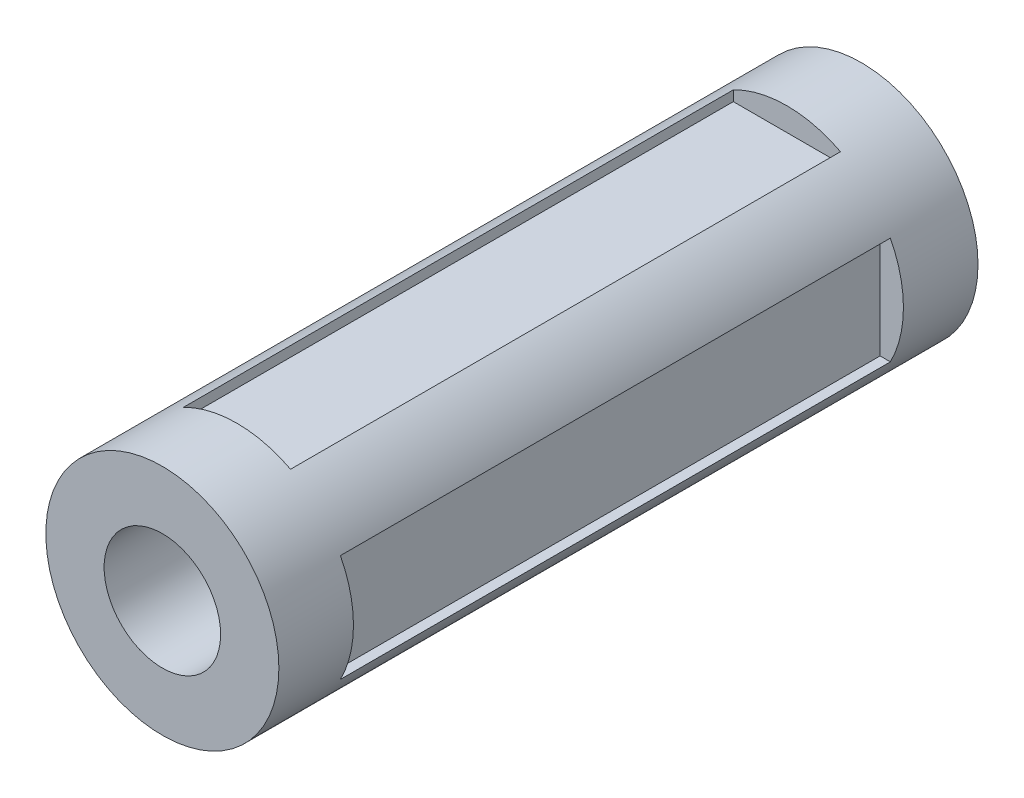
ISO-10303-21;
HEADER;
FILE_DESCRIPTION(('STEP AP214'),'2;1');
FILE_NAME('part.step','',(''),(''),'','','');
FILE_SCHEMA(('AUTOMOTIVE_DESIGN { 1 0 10303 214 1 1 1 1 }'));
ENDSEC;
DATA;
#1=APPLICATION_CONTEXT('core data for automotive mechanical design processes');
#2=APPLICATION_PROTOCOL_DEFINITION('international standard','automotive_design',2000,#1);
#3=PRODUCT_CONTEXT('',#1,'mechanical');
#4=PRODUCT('Part','Part','',(#3));
#5=PRODUCT_RELATED_PRODUCT_CATEGORY('part','',(#4));
#6=PRODUCT_DEFINITION_FORMATION('','',#4);
#7=PRODUCT_DEFINITION_CONTEXT('part definition',#1,'design');
#8=PRODUCT_DEFINITION('design','',#6,#7);
#9=PRODUCT_DEFINITION_SHAPE('','',#8);
#10=(LENGTH_UNIT() NAMED_UNIT(*) SI_UNIT(.MILLI.,.METRE.));
#11=(NAMED_UNIT(*) PLANE_ANGLE_UNIT() SI_UNIT($,.RADIAN.));
#12=(NAMED_UNIT(*) SI_UNIT($,.STERADIAN.) SOLID_ANGLE_UNIT());
#13=UNCERTAINTY_MEASURE_WITH_UNIT(LENGTH_MEASURE(1.E-05),#10,'distance_accuracy_value','');
#14=(GEOMETRIC_REPRESENTATION_CONTEXT(3) GLOBAL_UNCERTAINTY_ASSIGNED_CONTEXT((#13)) GLOBAL_UNIT_ASSIGNED_CONTEXT((#10,
#11,#12)) REPRESENTATION_CONTEXT('',''));
#15=CARTESIAN_POINT('',(0.,0.,0.));
#16=DIRECTION('',(0.,0.,1.));
#17=DIRECTION('',(1.,0.,0.));
#18=AXIS2_PLACEMENT_3D('',#15,#16,#17);
#19=CARTESIAN_POINT('',(0.,0.,300.));
#20=DIRECTION('',(0.,0.,-1.));
#21=DIRECTION('',(-1.,0.,0.));
#22=AXIS2_PLACEMENT_3D('',#19,#20,#21);
#23=CYLINDRICAL_SURFACE('',#22,50.);
#24=CARTESIAN_POINT('',(0.,0.,32.));
#25=DIRECTION('',(0.,0.,1.));
#26=DIRECTION('',(1.,0.,0.));
#27=AXIS2_PLACEMENT_3D('',#24,#25,#26);
#28=CIRCLE('',#27,50.);
#29=CARTESIAN_POINT('',(-22.9959939256583,-44.3980209398019,32.));
#30=VERTEX_POINT('',#29);
#31=CARTESIAN_POINT('',(22.9959939256583,-44.3980209398019,32.));
#32=VERTEX_POINT('',#31);
#33=EDGE_CURVE('E339',#30,#32,#28,.T.);
#34=ORIENTED_EDGE('',*,*,#33,.F.);
#35=CARTESIAN_POINT('',(-22.9999663385952,-44.3959631996366,268.0002));
#36=CARTESIAN_POINT('',(-22.9994052637973,-44.3962538724931,234.666866672656));
#37=CARTESIAN_POINT('',(-22.9988441889993,-44.3965445318595,201.333533345312));
#38=CARTESIAN_POINT('',(-22.9975200502315,-44.3972304572904,122.666733345312));
#39=CARTESIAN_POINT('',(-22.9967569862617,-44.3976257118937,77.3332666726562));
#40=CARTESIAN_POINT('',(-22.9959939222919,-44.3980209415455,31.9998));
#41=B_SPLINE_CURVE_WITH_KNOTS('',3,(#35,#36,#37,#38,#39,#40),.UNSPECIFIED.,.F.,.F.,(4,2,4),(0.,
100.,236.000400042403),.UNSPECIFIED.);
#42=CARTESIAN_POINT('',(-22.9999663352288,-44.3959632013806,268.));
#43=VERTEX_POINT('',#42);
#44=EDGE_CURVE('E357',#43,#30,#41,.T.);
#45=ORIENTED_EDGE('',*,*,#44,.F.);
#46=CARTESIAN_POINT('',(0.,0.,268.));
#47=DIRECTION('',(0.,0.,1.));
#48=DIRECTION('',(1.,0.,0.));
#49=AXIS2_PLACEMENT_3D('',#46,#47,#48);
#50=CIRCLE('',#49,50.);
#51=CARTESIAN_POINT('',(22.9999663352288,-44.3959632013807,268.));
#52=VERTEX_POINT('',#51);
#53=EDGE_CURVE('E60',#43,#52,#50,.T.);
#54=ORIENTED_EDGE('',*,*,#53,.T.);
#55=CARTESIAN_POINT('',(22.9959939222919,-44.3980209415455,31.9998));
#56=CARTESIAN_POINT('',(22.9965549970899,-44.397730332362,65.3331333273444));
#57=CARTESIAN_POINT('',(22.9971160718878,-44.3974397096885,98.6664666546888));
#58=CARTESIAN_POINT('',(22.9984402106556,-44.3967538071801,177.333266654689));
#59=CARTESIAN_POINT('',(22.9992032746254,-44.3963585158839,222.666733327345));
#60=CARTESIAN_POINT('',(22.9999663385952,-44.3959631996366,268.0002));
#61=B_SPLINE_CURVE_WITH_KNOTS('',3,(#55,#56,#57,#58,#59,#60),.UNSPECIFIED.,.F.,.F.,(4,2,4),(0.,
100.,236.000400042403),.UNSPECIFIED.);
#62=EDGE_CURVE('E393',#32,#52,#61,.T.);
#63=ORIENTED_EDGE('',*,*,#62,.F.);
#64=EDGE_LOOP('',(#34,#45,#54,#63));
#65=FACE_BOUND('',#64,.T.);
#66=CARTESIAN_POINT('',(0.,0.,32.));
#67=DIRECTION('',(0.,0.,1.));
#68=DIRECTION('',(1.,0.,0.));
#69=AXIS2_PLACEMENT_3D('',#66,#67,#68);
#70=CIRCLE('',#69,50.);
#71=CARTESIAN_POINT('',(22.9959939256583,44.3980209398019,32.));
#72=VERTEX_POINT('',#71);
#73=CARTESIAN_POINT('',(-22.9959939256583,44.3980209398019,32.));
#74=VERTEX_POINT('',#73);
#75=EDGE_CURVE('E252',#72,#74,#70,.T.);
#76=ORIENTED_EDGE('',*,*,#75,.F.);
#77=CARTESIAN_POINT('',(22.9999663385952,44.3959631996366,268.0002));
#78=CARTESIAN_POINT('',(22.9994052637973,44.3962538724931,234.666866672656));
#79=CARTESIAN_POINT('',(22.9988441889993,44.3965445318595,201.333533345312));
#80=CARTESIAN_POINT('',(22.9975200502315,44.3972304572904,122.666733345312));
#81=CARTESIAN_POINT('',(22.9967569862617,44.3976257118937,77.3332666726562));
#82=CARTESIAN_POINT('',(22.9959939222919,44.3980209415455,31.9998));
#83=B_SPLINE_CURVE_WITH_KNOTS('',3,(#77,#78,#79,#80,#81,#82),.UNSPECIFIED.,.F.,.F.,(4,2,4),(0.,
100.,236.000400042403),.UNSPECIFIED.);
#84=CARTESIAN_POINT('',(22.9999663352288,44.3959632013806,268.));
#85=VERTEX_POINT('',#84);
#86=EDGE_CURVE('E284',#85,#72,#83,.T.);
#87=ORIENTED_EDGE('',*,*,#86,.F.);
#88=CARTESIAN_POINT('',(0.,0.,268.));
#89=DIRECTION('',(0.,0.,1.));
#90=DIRECTION('',(1.,0.,0.));
#91=AXIS2_PLACEMENT_3D('',#88,#89,#90);
#92=CIRCLE('',#91,50.);
#93=CARTESIAN_POINT('',(-22.9999663352288,44.3959632013807,268.));
#94=VERTEX_POINT('',#93);
#95=EDGE_CURVE('E263',#85,#94,#92,.T.);
#96=ORIENTED_EDGE('',*,*,#95,.T.);
#97=CARTESIAN_POINT('',(-22.9959939222919,44.3980209415455,31.9998));
#98=CARTESIAN_POINT('',(-22.9965549970899,44.397730332362,65.3331333273444));
#99=CARTESIAN_POINT('',(-22.9971160718878,44.3974397096885,98.6664666546888));
#100=CARTESIAN_POINT('',(-22.9984402106556,44.3967538071801,177.333266654689));
#101=CARTESIAN_POINT('',(-22.9992032746254,44.3963585158839,222.666733327345));
#102=CARTESIAN_POINT('',(-22.9999663385952,44.3959631996366,268.0002));
#103=B_SPLINE_CURVE_WITH_KNOTS('',3,(#97,#98,#99,#100,#101,#102),.UNSPECIFIED.,.F.,.F.,(4,2,4),
(0.,100.,236.000400042403),.UNSPECIFIED.);
#104=EDGE_CURVE('E256',#74,#94,#103,.T.);
#105=ORIENTED_EDGE('',*,*,#104,.F.);
#106=EDGE_LOOP('',(#76,#87,#96,#105));
#107=FACE_BOUND('',#106,.T.);
#108=CARTESIAN_POINT('',(0.,0.,300.));
#109=DIRECTION('',(0.,0.,1.));
#110=DIRECTION('',(1.,0.,0.));
#111=AXIS2_PLACEMENT_3D('',#108,#109,#110);
#112=CIRCLE('',#111,50.);
#113=CARTESIAN_POINT('',(50.,0.,300.));
#114=VERTEX_POINT('',#113);
#115=EDGE_CURVE('E249',#114,#114,#112,.T.);
#116=ORIENTED_EDGE('',*,*,#115,.F.);
#117=EDGE_LOOP('',(#116));
#118=FACE_BOUND('',#117,.T.);
#119=CARTESIAN_POINT('',(0.,0.,0.));
#120=DIRECTION('',(0.,0.,1.));
#121=DIRECTION('',(1.,0.,0.));
#122=AXIS2_PLACEMENT_3D('',#119,#120,#121);
#123=CIRCLE('',#122,50.);
#124=CARTESIAN_POINT('',(50.,0.,0.));
#125=VERTEX_POINT('',#124);
#126=EDGE_CURVE('E246',#125,#125,#123,.T.);
#127=ORIENTED_EDGE('',*,*,#126,.T.);
#128=EDGE_LOOP('',(#127));
#129=FACE_BOUND('',#128,.T.);
#130=CARTESIAN_POINT('',(0.,0.,268.));
#131=DIRECTION('',(0.,0.,1.));
#132=DIRECTION('',(1.,0.,0.));
#133=AXIS2_PLACEMENT_3D('',#130,#131,#132);
#134=CIRCLE('',#133,50.);
#135=CARTESIAN_POINT('',(44.3959632013809,-22.9999663352283,268.));
#136=VERTEX_POINT('',#135);
#137=CARTESIAN_POINT('',(44.3959632013804,22.9999663352292,268.));
#138=VERTEX_POINT('',#137);
#139=EDGE_CURVE('E293',#136,#138,#134,.T.);
#140=ORIENTED_EDGE('',*,*,#139,.T.);
#141=CARTESIAN_POINT('',(44.3980209415453,22.9959939222923,31.9998));
#142=CARTESIAN_POINT('',(44.3977303323617,22.9965549970903,65.3331333273445));
#143=CARTESIAN_POINT('',(44.3974397096882,22.9971160718883,98.6664666546888));
#144=CARTESIAN_POINT('',(44.3967538071798,22.9984402106561,177.333266654689));
#145=CARTESIAN_POINT('',(44.3963585158837,22.9992032746259,222.666733327345));
#146=CARTESIAN_POINT('',(44.3959631996364,22.9999663385957,268.0002));
#147=B_SPLINE_CURVE_WITH_KNOTS('',3,(#141,#142,#143,#144,#145,#146),.UNSPECIFIED.,.F.,.F.,(4,2,
4),(0.,100.,236.000400042403),.UNSPECIFIED.);
#148=CARTESIAN_POINT('',(44.3980209398016,22.9959939256588,32.));
#149=VERTEX_POINT('',#148);
#150=EDGE_CURVE('E302',#149,#138,#147,.T.);
#151=ORIENTED_EDGE('',*,*,#150,.F.);
#152=CARTESIAN_POINT('',(0.,0.,32.));
#153=DIRECTION('',(0.,0.,1.));
#154=DIRECTION('',(1.,0.,0.));
#155=AXIS2_PLACEMENT_3D('',#152,#153,#154);
#156=CIRCLE('',#155,50.);
#157=CARTESIAN_POINT('',(44.3980209398021,-22.9959939256579,32.));
#158=VERTEX_POINT('',#157);
#159=EDGE_CURVE('E291',#158,#149,#156,.T.);
#160=ORIENTED_EDGE('',*,*,#159,.F.);
#161=CARTESIAN_POINT('',(44.3959631996368,-22.9999663385948,268.0002));
#162=CARTESIAN_POINT('',(44.3962538724933,-22.9994052637968,234.666866672656));
#163=CARTESIAN_POINT('',(44.3965445318597,-22.9988441889988,201.333533345312));
#164=CARTESIAN_POINT('',(44.3972304572907,-22.997520050231,122.666733345312));
#165=CARTESIAN_POINT('',(44.3976257118939,-22.9967569862612,77.3332666726562));
#166=CARTESIAN_POINT('',(44.3980209415458,-22.9959939222914,31.9998));
#167=B_SPLINE_CURVE_WITH_KNOTS('',3,(#161,#162,#163,#164,#165,#166),.UNSPECIFIED.,.F.,.F.,(4,2,
4),(0.,100.,236.000400042403),.UNSPECIFIED.);
#168=EDGE_CURVE('E295',#136,#158,#167,.T.);
#169=ORIENTED_EDGE('',*,*,#168,.F.);
#170=EDGE_LOOP('',(#140,#151,#160,#169));
#171=FACE_BOUND('',#170,.T.);
#172=CARTESIAN_POINT('',(0.,0.,32.));
#173=DIRECTION('',(0.,0.,1.));
#174=DIRECTION('',(1.,0.,0.));
#175=AXIS2_PLACEMENT_3D('',#172,#173,#174);
#176=CIRCLE('',#175,50.);
#177=CARTESIAN_POINT('',(-44.398020939802,22.9959939256582,32.));
#178=VERTEX_POINT('',#177);
#179=CARTESIAN_POINT('',(-44.3980209398018,-22.9959939256585,32.));
#180=VERTEX_POINT('',#179);
#181=EDGE_CURVE('E353',#178,#180,#176,.T.);
#182=ORIENTED_EDGE('',*,*,#181,.F.);
#183=CARTESIAN_POINT('',(-44.3959631996367,22.9999663385951,268.0002));
#184=CARTESIAN_POINT('',(-44.3962538724931,22.9994052637971,234.666866672656));
#185=CARTESIAN_POINT('',(-44.3965445318596,22.9988441889991,201.333533345312));
#186=CARTESIAN_POINT('',(-44.3972304572905,22.9975200502313,122.666733345312));
#187=CARTESIAN_POINT('',(-44.3976257118937,22.9967569862615,77.3332666726562));
#188=CARTESIAN_POINT('',(-44.3980209415456,22.9959939222917,31.9998));
#189=B_SPLINE_CURVE_WITH_KNOTS('',3,(#183,#184,#185,#186,#187,#188),.UNSPECIFIED.,.F.,.F.,(4,2,
4),(0.,100.,236.000400042403),.UNSPECIFIED.);
#190=CARTESIAN_POINT('',(-44.3959632013807,22.9999663352286,268.));
#191=VERTEX_POINT('',#190);
#192=EDGE_CURVE('E11',#191,#178,#189,.T.);
#193=ORIENTED_EDGE('',*,*,#192,.F.);
#194=CARTESIAN_POINT('',(0.,0.,268.));
#195=DIRECTION('',(0.,0.,1.));
#196=DIRECTION('',(1.,0.,0.));
#197=AXIS2_PLACEMENT_3D('',#194,#195,#196);
#198=CIRCLE('',#197,50.);
#199=CARTESIAN_POINT('',(-44.3959632013806,-22.9999663352289,268.));
#200=VERTEX_POINT('',#199);
#201=EDGE_CURVE('E46',#191,#200,#198,.T.);
#202=ORIENTED_EDGE('',*,*,#201,.T.);
#203=CARTESIAN_POINT('',(-44.3980209415454,-22.995993922292,31.9998));
#204=CARTESIAN_POINT('',(-44.3977303323619,-22.99655499709,65.3331333273444));
#205=CARTESIAN_POINT('',(-44.3974397096884,-22.997116071888,98.6664666546888));
#206=CARTESIAN_POINT('',(-44.39675380718,-22.9984402106558,177.333266654689));
#207=CARTESIAN_POINT('',(-44.3963585158838,-22.9992032746256,222.666733327345));
#208=CARTESIAN_POINT('',(-44.3959631996365,-22.9999663385954,268.0002));
#209=B_SPLINE_CURVE_WITH_KNOTS('',3,(#203,#204,#205,#206,#207,#208),.UNSPECIFIED.,.F.,.F.,(4,2,
4),(0.,100.,236.000400042403),.UNSPECIFIED.);
#210=EDGE_CURVE('E354',#180,#200,#209,.T.);
#211=ORIENTED_EDGE('',*,*,#210,.F.);
#212=EDGE_LOOP('',(#182,#193,#202,#211));
#213=FACE_BOUND('',#212,.T.);
#214=ADVANCED_FACE('F33',(#65,#107,#118,#129,#171,#213),#23,.T.);
#215=CARTESIAN_POINT('',(0.,0.,300.));
#216=DIRECTION('',(0.,0.,1.));
#217=DIRECTION('',(1.,0.,0.));
#218=AXIS2_PLACEMENT_3D('',#215,#216,#217);
#219=PLANE('',#218);
#220=ORIENTED_EDGE('',*,*,#115,.T.);
#221=EDGE_LOOP('',(#220));
#222=FACE_BOUND('',#221,.T.);
#223=CARTESIAN_POINT('',(0.,0.,300.));
#224=DIRECTION('',(0.,0.,1.));
#225=DIRECTION('',(1.,0.,0.));
#226=AXIS2_PLACEMENT_3D('',#223,#224,#225);
#227=CIRCLE('',#226,25.);
#228=CARTESIAN_POINT('',(25.,0.,300.));
#229=VERTEX_POINT('',#228);
#230=EDGE_CURVE('E243',#229,#229,#227,.T.);
#231=ORIENTED_EDGE('',*,*,#230,.F.);
#232=EDGE_LOOP('',(#231));
#233=FACE_BOUND('',#232,.T.);
#234=ADVANCED_FACE('F328',(#222,#233),#219,.T.);
#235=CARTESIAN_POINT('',(0.,0.,0.));
#236=DIRECTION('',(0.,0.,1.));
#237=DIRECTION('',(1.,0.,0.));
#238=AXIS2_PLACEMENT_3D('',#235,#236,#237);
#239=PLANE('',#238);
#240=ORIENTED_EDGE('',*,*,#126,.F.);
#241=EDGE_LOOP('',(#240));
#242=FACE_BOUND('',#241,.T.);
#243=CARTESIAN_POINT('',(0.,0.,0.));
#244=DIRECTION('',(0.,0.,1.));
#245=DIRECTION('',(1.,0.,0.));
#246=AXIS2_PLACEMENT_3D('',#243,#244,#245);
#247=CIRCLE('',#246,25.);
#248=CARTESIAN_POINT('',(25.,0.,0.));
#249=VERTEX_POINT('',#248);
#250=EDGE_CURVE('E234',#249,#249,#247,.T.);
#251=ORIENTED_EDGE('',*,*,#250,.T.);
#252=EDGE_LOOP('',(#251));
#253=FACE_BOUND('',#252,.T.);
#254=ADVANCED_FACE('F333',(#242,#253),#239,.F.);
#255=CARTESIAN_POINT('',(0.,0.,300.));
#256=DIRECTION('',(0.,0.,-1.));
#257=DIRECTION('',(-1.,0.,0.));
#258=AXIS2_PLACEMENT_3D('',#255,#256,#257);
#259=CYLINDRICAL_SURFACE('',#258,25.);
#260=ORIENTED_EDGE('',*,*,#230,.T.);
#261=EDGE_LOOP('',(#260));
#262=FACE_BOUND('',#261,.T.);
#263=ORIENTED_EDGE('',*,*,#250,.F.);
#264=EDGE_LOOP('',(#263));
#265=FACE_BOUND('',#264,.T.);
#266=ADVANCED_FACE('F545',(#262,#265),#259,.F.);
#267=CARTESIAN_POINT('',(-22.9999663352288,40.0000000000001,268.));
#268=DIRECTION('',(0.,0.,1.));
#269=DIRECTION('',(1.,0.,0.));
#270=AXIS2_PLACEMENT_3D('',#267,#268,#269);
#271=PLANE('',#270);
#272=DIRECTION('',(0.,1.,0.));
#273=VECTOR('',#272,1.);
#274=CARTESIAN_POINT('',(22.9999663352288,40.0000000000001,268.));
#275=LINE('',#274,#273);
#276=CARTESIAN_POINT('',(22.9999663352288,40.0000000000001,268.));
#277=VERTEX_POINT('',#276);
#278=EDGE_CURVE('E230',#277,#85,#275,.T.);
#279=ORIENTED_EDGE('',*,*,#278,.F.);
#280=DIRECTION('',(1.,0.,0.));
#281=VECTOR('',#280,1.);
#282=CARTESIAN_POINT('',(-22.9999663352288,40.0000000000001,268.));
#283=LINE('',#282,#281);
#284=CARTESIAN_POINT('',(-22.9999663352288,40.0000000000001,268.));
#285=VERTEX_POINT('',#284);
#286=EDGE_CURVE('E181',#285,#277,#283,.T.);
#287=ORIENTED_EDGE('',*,*,#286,.F.);
#288=DIRECTION('',(0.,1.,0.));
#289=VECTOR('',#288,1.);
#290=CARTESIAN_POINT('',(-22.9999663352288,40.0000000000001,268.));
#291=LINE('',#290,#289);
#292=EDGE_CURVE('E231',#285,#94,#291,.T.);
#293=ORIENTED_EDGE('',*,*,#292,.T.);
#294=ORIENTED_EDGE('',*,*,#95,.F.);
#295=EDGE_LOOP('',(#279,#287,#293,#294));
#296=FACE_BOUND('',#295,.T.);
#297=ADVANCED_FACE('F271',(#296),#271,.F.);
#298=CARTESIAN_POINT('',(-22.9999663352288,40.0000000000001,268.));
#299=DIRECTION('',(0.999999999858338,0.,1.68322439401052E-05));
#300=DIRECTION('',(1.68322439401052E-05,0.,-0.999999999858338));
#301=AXIS2_PLACEMENT_3D('',#298,#299,#300);
#302=PLANE('',#301);
#303=ORIENTED_EDGE('',*,*,#104,.T.);
#304=ORIENTED_EDGE('',*,*,#292,.F.);
#305=DIRECTION('',(1.68322439401052E-05,0.,-0.999999999858338));
#306=VECTOR('',#305,1.);
#307=CARTESIAN_POINT('',(-22.9999663352288,40.0000000000001,268.));
#308=LINE('',#307,#306);
#309=CARTESIAN_POINT('',(-22.9959939256583,40.0000000000001,32.));
#310=VERTEX_POINT('',#309);
#311=EDGE_CURVE('E228',#285,#310,#308,.T.);
#312=ORIENTED_EDGE('',*,*,#311,.T.);
#313=DIRECTION('',(0.,1.,0.));
#314=VECTOR('',#313,1.);
#315=CARTESIAN_POINT('',(-22.9959939256583,40.0000000000001,32.));
#316=LINE('',#315,#314);
#317=EDGE_CURVE('E235',#310,#74,#316,.T.);
#318=ORIENTED_EDGE('',*,*,#317,.T.);
#319=EDGE_LOOP('',(#303,#304,#312,#318));
#320=FACE_BOUND('',#319,.T.);
#321=ADVANCED_FACE('F265',(#320),#302,.T.);
#322=CARTESIAN_POINT('',(-22.9959939256583,40.0000000000001,32.));
#323=DIRECTION('',(0.,0.,1.));
#324=DIRECTION('',(1.,0.,0.));
#325=AXIS2_PLACEMENT_3D('',#322,#323,#324);
#326=PLANE('',#325);
#327=DIRECTION('',(0.,1.,0.));
#328=VECTOR('',#327,1.);
#329=CARTESIAN_POINT('',(22.9959939256583,40.0000000000001,32.));
#330=LINE('',#329,#328);
#331=CARTESIAN_POINT('',(22.9959939256583,40.0000000000001,32.));
#332=VERTEX_POINT('',#331);
#333=EDGE_CURVE('E238',#332,#72,#330,.T.);
#334=ORIENTED_EDGE('',*,*,#333,.T.);
#335=ORIENTED_EDGE('',*,*,#75,.T.);
#336=ORIENTED_EDGE('',*,*,#317,.F.);
#337=DIRECTION('',(1.,0.,0.));
#338=VECTOR('',#337,1.);
#339=CARTESIAN_POINT('',(-22.9959939256583,40.0000000000001,32.));
#340=LINE('',#339,#338);
#341=EDGE_CURVE('E226',#310,#332,#340,.T.);
#342=ORIENTED_EDGE('',*,*,#341,.T.);
#343=EDGE_LOOP('',(#334,#335,#336,#342));
#344=FACE_BOUND('',#343,.T.);
#345=ADVANCED_FACE('F270',(#344),#326,.T.);
#346=CARTESIAN_POINT('',(22.9959939256583,40.0000000000001,32.));
#347=DIRECTION('',(-0.999999999858338,0.,1.68322439401934E-05));
#348=DIRECTION('',(1.68322439401934E-05,0.,0.999999999858338));
#349=AXIS2_PLACEMENT_3D('',#346,#347,#348);
#350=PLANE('',#349);
#351=ORIENTED_EDGE('',*,*,#86,.T.);
#352=ORIENTED_EDGE('',*,*,#333,.F.);
#353=DIRECTION('',(1.68322439401934E-05,0.,0.999999999858338));
#354=VECTOR('',#353,1.);
#355=CARTESIAN_POINT('',(22.9959939256583,40.0000000000001,32.));
#356=LINE('',#355,#354);
#357=EDGE_CURVE('E224',#332,#277,#356,.T.);
#358=ORIENTED_EDGE('',*,*,#357,.T.);
#359=ORIENTED_EDGE('',*,*,#278,.T.);
#360=EDGE_LOOP('',(#351,#352,#358,#359));
#361=FACE_BOUND('',#360,.T.);
#362=ADVANCED_FACE('F277',(#361),#350,.T.);
#363=CARTESIAN_POINT('',(0.,40.0000000000001,0.));
#364=DIRECTION('',(0.,-1.,0.));
#365=DIRECTION('',(0.,0.,-1.));
#366=AXIS2_PLACEMENT_3D('',#363,#364,#365);
#367=PLANE('',#366);
#368=ORIENTED_EDGE('',*,*,#286,.T.);
#369=ORIENTED_EDGE('',*,*,#357,.F.);
#370=ORIENTED_EDGE('',*,*,#341,.F.);
#371=ORIENTED_EDGE('',*,*,#311,.F.);
#372=EDGE_LOOP('',(#368,#369,#370,#371));
#373=FACE_BOUND('',#372,.T.);
#374=ADVANCED_FACE('F273',(#373),#367,.F.);
#375=CARTESIAN_POINT('',(39.9999999999999,22.9999663352292,268.));
#376=DIRECTION('',(0.,0.,1.));
#377=DIRECTION('',(1.,0.,0.));
#378=AXIS2_PLACEMENT_3D('',#375,#376,#377);
#379=PLANE('',#378);
#380=ORIENTED_EDGE('',*,*,#139,.F.);
#381=DIRECTION('',(1.,0.,0.));
#382=VECTOR('',#381,1.);
#383=CARTESIAN_POINT('',(40.0000000000004,-22.9999663352284,268.));
#384=LINE('',#383,#382);
#385=CARTESIAN_POINT('',(40.0000000000004,-22.9999663352284,268.));
#386=VERTEX_POINT('',#385);
#387=EDGE_CURVE('E212',#386,#136,#384,.T.);
#388=ORIENTED_EDGE('',*,*,#387,.F.);
#389=DIRECTION('',(0.,-1.,0.));
#390=VECTOR('',#389,1.);
#391=CARTESIAN_POINT('',(39.9999999999999,22.9999663352292,268.));
#392=LINE('',#391,#390);
#393=CARTESIAN_POINT('',(39.9999999999999,22.9999663352292,268.));
#394=VERTEX_POINT('',#393);
#395=EDGE_CURVE('E203',#394,#386,#392,.T.);
#396=ORIENTED_EDGE('',*,*,#395,.F.);
#397=DIRECTION('',(1.,0.,0.));
#398=VECTOR('',#397,1.);
#399=CARTESIAN_POINT('',(39.9999999999999,22.9999663352292,268.));
#400=LINE('',#399,#398);
#401=EDGE_CURVE('E190',#394,#138,#400,.T.);
#402=ORIENTED_EDGE('',*,*,#401,.T.);
#403=EDGE_LOOP('',(#380,#388,#396,#402));
#404=FACE_BOUND('',#403,.T.);
#405=ADVANCED_FACE('F316',(#404),#379,.F.);
#406=CARTESIAN_POINT('',(39.9999999999999,22.9999663352292,268.));
#407=DIRECTION('',(0.,-0.999999999858338,1.68322439401052E-05));
#408=DIRECTION('',(0.,-1.68322439401052E-05,-0.999999999858338));
#409=AXIS2_PLACEMENT_3D('',#406,#407,#408);
#410=PLANE('',#409);
#411=ORIENTED_EDGE('',*,*,#150,.T.);
#412=ORIENTED_EDGE('',*,*,#401,.F.);
#413=DIRECTION('',(0.,-1.68322439401052E-05,-0.999999999858338));
#414=VECTOR('',#413,1.);
#415=CARTESIAN_POINT('',(39.9999999999999,22.9999663352292,268.));
#416=LINE('',#415,#414);
#417=CARTESIAN_POINT('',(39.9999999999999,22.9959939256588,32.));
#418=VERTEX_POINT('',#417);
#419=EDGE_CURVE('E210',#394,#418,#416,.T.);
#420=ORIENTED_EDGE('',*,*,#419,.T.);
#421=DIRECTION('',(1.,0.,0.));
#422=VECTOR('',#421,1.);
#423=CARTESIAN_POINT('',(39.9999999999999,22.9959939256588,32.));
#424=LINE('',#423,#422);
#425=EDGE_CURVE('E215',#418,#149,#424,.T.);
#426=ORIENTED_EDGE('',*,*,#425,.T.);
#427=EDGE_LOOP('',(#411,#412,#420,#426));
#428=FACE_BOUND('',#427,.T.);
#429=ADVANCED_FACE('F318',(#428),#410,.T.);
#430=CARTESIAN_POINT('',(39.9999999999999,22.9959939256588,32.));
#431=DIRECTION('',(0.,0.,1.));
#432=DIRECTION('',(1.,0.,0.));
#433=AXIS2_PLACEMENT_3D('',#430,#431,#432);
#434=PLANE('',#433);
#435=ORIENTED_EDGE('',*,*,#159,.T.);
#436=ORIENTED_EDGE('',*,*,#425,.F.);
#437=DIRECTION('',(0.,-1.,0.));
#438=VECTOR('',#437,1.);
#439=CARTESIAN_POINT('',(39.9999999999999,22.9959939256588,32.));
#440=LINE('',#439,#438);
#441=CARTESIAN_POINT('',(40.0000000000004,-22.9959939256579,32.));
#442=VERTEX_POINT('',#441);
#443=EDGE_CURVE('E208',#418,#442,#440,.T.);
#444=ORIENTED_EDGE('',*,*,#443,.T.);
#445=DIRECTION('',(1.,0.,0.));
#446=VECTOR('',#445,1.);
#447=CARTESIAN_POINT('',(40.0000000000004,-22.9959939256579,32.));
#448=LINE('',#447,#446);
#449=EDGE_CURVE('E218',#442,#158,#448,.T.);
#450=ORIENTED_EDGE('',*,*,#449,.T.);
#451=EDGE_LOOP('',(#435,#436,#444,#450));
#452=FACE_BOUND('',#451,.T.);
#453=ADVANCED_FACE('F314',(#452),#434,.T.);
#454=CARTESIAN_POINT('',(40.0000000000004,-22.9959939256579,32.));
#455=DIRECTION('',(0.,0.999999999858338,1.68322439401934E-05));
#456=DIRECTION('',(0.,-1.68322439401934E-05,0.999999999858338));
#457=AXIS2_PLACEMENT_3D('',#454,#455,#456);
#458=PLANE('',#457);
#459=ORIENTED_EDGE('',*,*,#168,.T.);
#460=ORIENTED_EDGE('',*,*,#449,.F.);
#461=DIRECTION('',(0.,-1.68322439401934E-05,0.999999999858338));
#462=VECTOR('',#461,1.);
#463=CARTESIAN_POINT('',(40.0000000000004,-22.9959939256579,32.));
#464=LINE('',#463,#462);
#465=EDGE_CURVE('E206',#442,#386,#464,.T.);
#466=ORIENTED_EDGE('',*,*,#465,.T.);
#467=ORIENTED_EDGE('',*,*,#387,.T.);
#468=EDGE_LOOP('',(#459,#460,#466,#467));
#469=FACE_BOUND('',#468,.T.);
#470=ADVANCED_FACE('F309',(#469),#458,.T.);
#471=CARTESIAN_POINT('',(40.0000000000001,4.18977760661177E-13,0.));
#472=DIRECTION('',(-1.,0.,0.));
#473=DIRECTION('',(0.,0.,-1.));
#474=AXIS2_PLACEMENT_3D('',#471,#472,#473);
#475=PLANE('',#474);
#476=ORIENTED_EDGE('',*,*,#395,.T.);
#477=ORIENTED_EDGE('',*,*,#465,.F.);
#478=ORIENTED_EDGE('',*,*,#443,.F.);
#479=ORIENTED_EDGE('',*,*,#419,.F.);
#480=EDGE_LOOP('',(#476,#477,#478,#479));
#481=FACE_BOUND('',#480,.T.);
#482=ADVANCED_FACE('F313',(#481),#475,.F.);
#483=CARTESIAN_POINT('',(22.9999663352288,-40.0000000000001,268.));
#484=DIRECTION('',(0.,0.,1.));
#485=DIRECTION('',(1.,0.,0.));
#486=AXIS2_PLACEMENT_3D('',#483,#484,#485);
#487=PLANE('',#486);
#488=DIRECTION('',(0.,-1.,0.));
#489=VECTOR('',#488,1.);
#490=CARTESIAN_POINT('',(-22.9999663352288,-40.0000000000001,268.));
#491=LINE('',#490,#489);
#492=CARTESIAN_POINT('',(-22.9999663352288,-40.0000000000001,268.));
#493=VERTEX_POINT('',#492);
#494=EDGE_CURVE('E195',#493,#43,#491,.T.);
#495=ORIENTED_EDGE('',*,*,#494,.F.);
#496=DIRECTION('',(-1.,0.,0.));
#497=VECTOR('',#496,1.);
#498=CARTESIAN_POINT('',(22.9999663352288,-40.0000000000001,268.));
#499=LINE('',#498,#497);
#500=CARTESIAN_POINT('',(22.9999663352288,-40.0000000000001,268.));
#501=VERTEX_POINT('',#500);
#502=EDGE_CURVE('E186',#501,#493,#499,.T.);
#503=ORIENTED_EDGE('',*,*,#502,.F.);
#504=DIRECTION('',(0.,-1.,0.));
#505=VECTOR('',#504,1.);
#506=CARTESIAN_POINT('',(22.9999663352288,-40.0000000000001,268.));
#507=LINE('',#506,#505);
#508=EDGE_CURVE('E172',#501,#52,#507,.T.);
#509=ORIENTED_EDGE('',*,*,#508,.T.);
#510=ORIENTED_EDGE('',*,*,#53,.F.);
#511=EDGE_LOOP('',(#495,#503,#509,#510));
#512=FACE_BOUND('',#511,.T.);
#513=ADVANCED_FACE('F389',(#512),#487,.F.);
#514=CARTESIAN_POINT('',(22.9999663352288,-40.0000000000001,268.));
#515=DIRECTION('',(-0.999999999858338,0.,1.68322439401052E-05));
#516=DIRECTION('',(1.68322439401052E-05,0.,0.999999999858338));
#517=AXIS2_PLACEMENT_3D('',#514,#515,#516);
#518=PLANE('',#517);
#519=ORIENTED_EDGE('',*,*,#62,.T.);
#520=ORIENTED_EDGE('',*,*,#508,.F.);
#521=DIRECTION('',(-1.68322439401052E-05,0.,-0.999999999858338));
#522=VECTOR('',#521,1.);
#523=CARTESIAN_POINT('',(22.9999663352288,-40.0000000000001,268.));
#524=LINE('',#523,#522);
#525=CARTESIAN_POINT('',(22.9959939256583,-40.0000000000001,32.));
#526=VERTEX_POINT('',#525);
#527=EDGE_CURVE('E194',#501,#526,#524,.T.);
#528=ORIENTED_EDGE('',*,*,#527,.T.);
#529=DIRECTION('',(0.,-1.,0.));
#530=VECTOR('',#529,1.);
#531=CARTESIAN_POINT('',(22.9959939256583,-40.0000000000001,32.));
#532=LINE('',#531,#530);
#533=EDGE_CURVE('E174',#526,#32,#532,.T.);
#534=ORIENTED_EDGE('',*,*,#533,.T.);
#535=EDGE_LOOP('',(#519,#520,#528,#534));
#536=FACE_BOUND('',#535,.T.);
#537=ADVANCED_FACE('F384',(#536),#518,.T.);
#538=CARTESIAN_POINT('',(22.9959939256583,-40.0000000000001,32.));
#539=DIRECTION('',(0.,0.,1.));
#540=DIRECTION('',(1.,0.,0.));
#541=AXIS2_PLACEMENT_3D('',#538,#539,#540);
#542=PLANE('',#541);
#543=DIRECTION('',(0.,-1.,0.));
#544=VECTOR('',#543,1.);
#545=CARTESIAN_POINT('',(-22.9959939256583,-40.0000000000001,32.));
#546=LINE('',#545,#544);
#547=CARTESIAN_POINT('',(-22.9959939256583,-40.0000000000001,32.));
#548=VERTEX_POINT('',#547);
#549=EDGE_CURVE('E199',#548,#30,#546,.T.);
#550=ORIENTED_EDGE('',*,*,#549,.T.);
#551=ORIENTED_EDGE('',*,*,#33,.T.);
#552=ORIENTED_EDGE('',*,*,#533,.F.);
#553=DIRECTION('',(-1.,0.,0.));
#554=VECTOR('',#553,1.);
#555=CARTESIAN_POINT('',(22.9959939256583,-40.0000000000001,32.));
#556=LINE('',#555,#554);
#557=EDGE_CURVE('E192',#526,#548,#556,.T.);
#558=ORIENTED_EDGE('',*,*,#557,.T.);
#559=EDGE_LOOP('',(#550,#551,#552,#558));
#560=FACE_BOUND('',#559,.T.);
#561=ADVANCED_FACE('F388',(#560),#542,.T.);
#562=CARTESIAN_POINT('',(-22.9959939256583,-40.0000000000001,32.));
#563=DIRECTION('',(0.999999999858338,0.,1.68322439401934E-05));
#564=DIRECTION('',(1.68322439401934E-05,0.,-0.999999999858338));
#565=AXIS2_PLACEMENT_3D('',#562,#563,#564);
#566=PLANE('',#565);
#567=ORIENTED_EDGE('',*,*,#44,.T.);
#568=ORIENTED_EDGE('',*,*,#549,.F.);
#569=DIRECTION('',(-1.68322439401934E-05,0.,0.999999999858338));
#570=VECTOR('',#569,1.);
#571=CARTESIAN_POINT('',(-22.9959939256583,-40.0000000000001,32.));
#572=LINE('',#571,#570);
#573=EDGE_CURVE('E189',#548,#493,#572,.T.);
#574=ORIENTED_EDGE('',*,*,#573,.T.);
#575=ORIENTED_EDGE('',*,*,#494,.T.);
#576=EDGE_LOOP('',(#567,#568,#574,#575));
#577=FACE_BOUND('',#576,.T.);
#578=ADVANCED_FACE('F382',(#577),#566,.T.);
#579=CARTESIAN_POINT('',(0.,-40.0000000000001,0.));
#580=DIRECTION('',(0.,1.,0.));
#581=DIRECTION('',(0.,0.,-1.));
#582=AXIS2_PLACEMENT_3D('',#579,#580,#581);
#583=PLANE('',#582);
#584=ORIENTED_EDGE('',*,*,#502,.T.);
#585=ORIENTED_EDGE('',*,*,#573,.F.);
#586=ORIENTED_EDGE('',*,*,#557,.F.);
#587=ORIENTED_EDGE('',*,*,#527,.F.);
#588=EDGE_LOOP('',(#584,#585,#586,#587));
#589=FACE_BOUND('',#588,.T.);
#590=ADVANCED_FACE('F379',(#589),#583,.F.);
#591=CARTESIAN_POINT('',(-40.,-22.9999663352289,268.));
#592=DIRECTION('',(0.,0.,1.));
#593=DIRECTION('',(1.,0.,0.));
#594=AXIS2_PLACEMENT_3D('',#591,#592,#593);
#595=PLANE('',#594);
#596=DIRECTION('',(-1.,0.,0.));
#597=VECTOR('',#596,1.);
#598=CARTESIAN_POINT('',(-40.0000000000002,22.9999663352286,268.));
#599=LINE('',#598,#597);
#600=CARTESIAN_POINT('',(-40.0000000000002,22.9999663352286,268.));
#601=VERTEX_POINT('',#600);
#602=EDGE_CURVE('E156',#601,#191,#599,.T.);
#603=ORIENTED_EDGE('',*,*,#602,.F.);
#604=DIRECTION('',(0.,1.,0.));
#605=VECTOR('',#604,1.);
#606=CARTESIAN_POINT('',(-40.,-22.9999663352289,268.));
#607=LINE('',#606,#605);
#608=CARTESIAN_POINT('',(-40.,-22.9999663352289,268.));
#609=VERTEX_POINT('',#608);
#610=EDGE_CURVE('E164',#609,#601,#607,.T.);
#611=ORIENTED_EDGE('',*,*,#610,.F.);
#612=DIRECTION('',(-1.,0.,0.));
#613=VECTOR('',#612,1.);
#614=CARTESIAN_POINT('',(-40.,-22.9999663352289,268.));
#615=LINE('',#614,#613);
#616=EDGE_CURVE('E179',#609,#200,#615,.T.);
#617=ORIENTED_EDGE('',*,*,#616,.T.);
#618=ORIENTED_EDGE('',*,*,#201,.F.);
#619=EDGE_LOOP('',(#603,#611,#617,#618));
#620=FACE_BOUND('',#619,.T.);
#621=ADVANCED_FACE('F167',(#620),#595,.F.);
#622=CARTESIAN_POINT('',(-40.,-22.9999663352289,268.));
#623=DIRECTION('',(0.,0.999999999858338,1.68322439401052E-05));
#624=DIRECTION('',(0.,-1.68322439401052E-05,0.999999999858338));
#625=AXIS2_PLACEMENT_3D('',#622,#623,#624);
#626=PLANE('',#625);
#627=ORIENTED_EDGE('',*,*,#210,.T.);
#628=ORIENTED_EDGE('',*,*,#616,.F.);
#629=DIRECTION('',(0.,1.68322439401052E-05,-0.999999999858338));
#630=VECTOR('',#629,1.);
#631=CARTESIAN_POINT('',(-40.,-22.9999663352289,268.));
#632=LINE('',#631,#630);
#633=CARTESIAN_POINT('',(-40.,-22.9959939256585,32.));
#634=VERTEX_POINT('',#633);
#635=EDGE_CURVE('E168',#609,#634,#632,.T.);
#636=ORIENTED_EDGE('',*,*,#635,.T.);
#637=DIRECTION('',(-1.,0.,0.));
#638=VECTOR('',#637,1.);
#639=CARTESIAN_POINT('',(-40.,-22.9959939256585,32.));
#640=LINE('',#639,#638);
#641=EDGE_CURVE('E182',#634,#180,#640,.T.);
#642=ORIENTED_EDGE('',*,*,#641,.T.);
#643=EDGE_LOOP('',(#627,#628,#636,#642));
#644=FACE_BOUND('',#643,.T.);
#645=ADVANCED_FACE('F361',(#644),#626,.T.);
#646=CARTESIAN_POINT('',(-40.,-22.9959939256585,32.));
#647=DIRECTION('',(0.,0.,1.));
#648=DIRECTION('',(1.,0.,0.));
#649=AXIS2_PLACEMENT_3D('',#646,#647,#648);
#650=PLANE('',#649);
#651=DIRECTION('',(-1.,0.,0.));
#652=VECTOR('',#651,1.);
#653=CARTESIAN_POINT('',(-40.0000000000002,22.9959939256582,32.));
#654=LINE('',#653,#652);
#655=CARTESIAN_POINT('',(-40.0000000000002,22.9959939256582,32.));
#656=VERTEX_POINT('',#655);
#657=EDGE_CURVE('E159',#656,#178,#654,.T.);
#658=ORIENTED_EDGE('',*,*,#657,.T.);
#659=ORIENTED_EDGE('',*,*,#181,.T.);
#660=ORIENTED_EDGE('',*,*,#641,.F.);
#661=DIRECTION('',(0.,1.,0.));
#662=VECTOR('',#661,1.);
#663=CARTESIAN_POINT('',(-40.,-22.9959939256585,32.));
#664=LINE('',#663,#662);
#665=EDGE_CURVE('E163',#634,#656,#664,.T.);
#666=ORIENTED_EDGE('',*,*,#665,.T.);
#667=EDGE_LOOP('',(#658,#659,#660,#666));
#668=FACE_BOUND('',#667,.T.);
#669=ADVANCED_FACE('F359',(#668),#650,.T.);
#670=CARTESIAN_POINT('',(-40.0000000000002,22.9959939256582,32.));
#671=DIRECTION('',(0.,-0.999999999858338,1.68322439401934E-05));
#672=DIRECTION('',(0.,-1.68322439401934E-05,-0.999999999858338));
#673=AXIS2_PLACEMENT_3D('',#670,#671,#672);
#674=PLANE('',#673);
#675=ORIENTED_EDGE('',*,*,#192,.T.);
#676=ORIENTED_EDGE('',*,*,#657,.F.);
#677=DIRECTION('',(0.,1.68322439401934E-05,0.999999999858338));
#678=VECTOR('',#677,1.);
#679=CARTESIAN_POINT('',(-40.0000000000002,22.9959939256582,32.));
#680=LINE('',#679,#678);
#681=EDGE_CURVE('E154',#656,#601,#680,.T.);
#682=ORIENTED_EDGE('',*,*,#681,.T.);
#683=ORIENTED_EDGE('',*,*,#602,.T.);
#684=EDGE_LOOP('',(#675,#676,#682,#683));
#685=FACE_BOUND('',#684,.T.);
#686=ADVANCED_FACE('F155',(#685),#674,.T.);
#687=CARTESIAN_POINT('',(-40.0000000000001,-1.39659253553726E-13,0.));
#688=DIRECTION('',(1.,0.,0.));
#689=DIRECTION('',(0.,0.,-1.));
#690=AXIS2_PLACEMENT_3D('',#687,#688,#689);
#691=PLANE('',#690);
#692=ORIENTED_EDGE('',*,*,#610,.T.);
#693=ORIENTED_EDGE('',*,*,#681,.F.);
#694=ORIENTED_EDGE('',*,*,#665,.F.);
#695=ORIENTED_EDGE('',*,*,#635,.F.);
#696=EDGE_LOOP('',(#692,#693,#694,#695));
#697=FACE_BOUND('',#696,.T.);
#698=ADVANCED_FACE('F171',(#697),#691,.F.);
#699=CLOSED_SHELL('',(#214,#234,#254,#266,#297,#321,#345,#362,#374,#405,#429,#453,#470,#482,
#513,#537,#561,#578,#590,#621,#645,#669,#686,#698));
#700=MANIFOLD_SOLID_BREP('B2',#699);
#701=ADVANCED_BREP_SHAPE_REPRESENTATION('',(#18,#700),#14);
#702=SHAPE_DEFINITION_REPRESENTATION(#9,#701);
ENDSEC;
END-ISO-10303-21;
